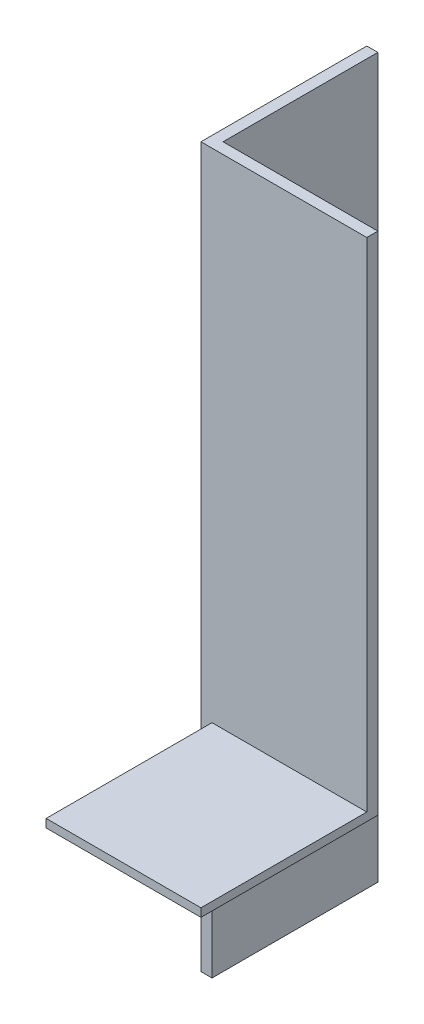
ISO-10303-21;
HEADER;
FILE_DESCRIPTION(('STEP AP214'),'2;1');
FILE_NAME('part.step','',(''),(''),'','','');
FILE_SCHEMA(('AUTOMOTIVE_DESIGN { 1 0 10303 214 1 1 1 1 }'));
ENDSEC;
DATA;
#1=APPLICATION_CONTEXT('core data for automotive mechanical design processes');
#2=APPLICATION_PROTOCOL_DEFINITION('international standard','automotive_design',2000,#1);
#3=PRODUCT_CONTEXT('',#1,'mechanical');
#4=PRODUCT('Part','Part','',(#3));
#5=PRODUCT_RELATED_PRODUCT_CATEGORY('part','',(#4));
#6=PRODUCT_DEFINITION_FORMATION('','',#4);
#7=PRODUCT_DEFINITION_CONTEXT('part definition',#1,'design');
#8=PRODUCT_DEFINITION('design','',#6,#7);
#9=PRODUCT_DEFINITION_SHAPE('','',#8);
#10=(LENGTH_UNIT() NAMED_UNIT(*) SI_UNIT(.MILLI.,.METRE.));
#11=(NAMED_UNIT(*) PLANE_ANGLE_UNIT() SI_UNIT($,.RADIAN.));
#12=(NAMED_UNIT(*) SI_UNIT($,.STERADIAN.) SOLID_ANGLE_UNIT());
#13=UNCERTAINTY_MEASURE_WITH_UNIT(LENGTH_MEASURE(1.E-05),#10,'distance_accuracy_value','');
#14=(GEOMETRIC_REPRESENTATION_CONTEXT(3) GLOBAL_UNCERTAINTY_ASSIGNED_CONTEXT((#13)) GLOBAL_UNIT_ASSIGNED_CONTEXT((#10,
#11,#12)) REPRESENTATION_CONTEXT('',''));
#15=CARTESIAN_POINT('',(0.,0.,0.));
#16=DIRECTION('',(0.,0.,1.));
#17=DIRECTION('',(1.,0.,0.));
#18=AXIS2_PLACEMENT_3D('',#15,#16,#17);
#19=CARTESIAN_POINT('',(15.,65.,0.));
#20=DIRECTION('',(0.,0.,-1.));
#21=DIRECTION('',(-1.,0.,0.));
#22=AXIS2_PLACEMENT_3D('',#19,#20,#21);
#23=PLANE('',#22);
#24=DIRECTION('',(0.,-1.,0.));
#25=VECTOR('',#24,1.);
#26=CARTESIAN_POINT('',(0.999999999999998,34.0356688476182,0.));
#27=LINE('',#26,#25);
#28=CARTESIAN_POINT('',(0.999999999999998,20.,0.));
#29=VERTEX_POINT('',#28);
#30=CARTESIAN_POINT('',(0.999999999999998,19.25,0.));
#31=VERTEX_POINT('',#30);
#32=EDGE_CURVE('E147',#29,#31,#27,.T.);
#33=ORIENTED_EDGE('',*,*,#32,.F.);
#34=DIRECTION('',(-1.,0.,0.));
#35=VECTOR('',#34,1.);
#36=CARTESIAN_POINT('',(15.,20.,0.));
#37=LINE('',#36,#35);
#38=CARTESIAN_POINT('',(15.,20.,0.));
#39=VERTEX_POINT('',#38);
#40=EDGE_CURVE('E113',#39,#29,#37,.T.);
#41=ORIENTED_EDGE('',*,*,#40,.F.);
#42=DIRECTION('',(0.,-1.,0.));
#43=VECTOR('',#42,1.);
#44=CARTESIAN_POINT('',(15.,65.,0.));
#45=LINE('',#44,#43);
#46=CARTESIAN_POINT('',(15.,65.,0.));
#47=VERTEX_POINT('',#46);
#48=EDGE_CURVE('E11',#47,#39,#45,.T.);
#49=ORIENTED_EDGE('',*,*,#48,.F.);
#50=DIRECTION('',(1.,0.,0.));
#51=VECTOR('',#50,1.);
#52=CARTESIAN_POINT('',(15.,65.,0.));
#53=LINE('',#52,#51);
#54=CARTESIAN_POINT('',(0.,65.,0.));
#55=VERTEX_POINT('',#54);
#56=EDGE_CURVE('E150',#55,#47,#53,.T.);
#57=ORIENTED_EDGE('',*,*,#56,.F.);
#58=DIRECTION('',(0.,-1.,0.));
#59=VECTOR('',#58,1.);
#60=CARTESIAN_POINT('',(0.,65.,0.));
#61=LINE('',#60,#59);
#62=CARTESIAN_POINT('',(0.,0.,0.));
#63=VERTEX_POINT('',#62);
#64=EDGE_CURVE('E164',#55,#63,#61,.T.);
#65=ORIENTED_EDGE('',*,*,#64,.T.);
#66=DIRECTION('',(1.,0.,0.));
#67=VECTOR('',#66,1.);
#68=CARTESIAN_POINT('',(15.,0.,0.));
#69=LINE('',#68,#67);
#70=CARTESIAN_POINT('',(0.999999999999999,0.,0.));
#71=VERTEX_POINT('',#70);
#72=EDGE_CURVE('E149',#63,#71,#69,.T.);
#73=ORIENTED_EDGE('',*,*,#72,.T.);
#74=EDGE_CURVE('E146',#31,#71,#27,.T.);
#75=ORIENTED_EDGE('',*,*,#74,.F.);
#76=EDGE_LOOP('',(#33,#41,#49,#57,#65,#73,#75));
#77=FACE_BOUND('',#76,.T.);
#78=ADVANCED_FACE('F35',(#77),#23,.F.);
#79=CARTESIAN_POINT('',(15.,65.,-0.999999999999998));
#80=DIRECTION('',(-1.,0.,0.));
#81=DIRECTION('',(0.,0.,1.));
#82=AXIS2_PLACEMENT_3D('',#79,#80,#81);
#83=PLANE('',#82);
#84=ORIENTED_EDGE('',*,*,#48,.T.);
#85=DIRECTION('',(0.,0.,-1.));
#86=VECTOR('',#85,1.);
#87=CARTESIAN_POINT('',(15.,20.,15.));
#88=LINE('',#87,#86);
#89=CARTESIAN_POINT('',(15.,20.,15.));
#90=VERTEX_POINT('',#89);
#91=EDGE_CURVE('E117',#90,#39,#88,.T.);
#92=ORIENTED_EDGE('',*,*,#91,.F.);
#93=DIRECTION('',(0.,-1.,0.));
#94=VECTOR('',#93,1.);
#95=CARTESIAN_POINT('',(15.,20.,15.));
#96=LINE('',#95,#94);
#97=CARTESIAN_POINT('',(15.,19.25,15.));
#98=VERTEX_POINT('',#97);
#99=EDGE_CURVE('E128',#90,#98,#96,.T.);
#100=ORIENTED_EDGE('',*,*,#99,.T.);
#101=DIRECTION('',(0.,0.,-1.));
#102=VECTOR('',#101,1.);
#103=CARTESIAN_POINT('',(15.,19.25,15.));
#104=LINE('',#103,#102);
#105=CARTESIAN_POINT('',(15.,19.25,-0.999999999999997));
#106=VERTEX_POINT('',#105);
#107=EDGE_CURVE('E141',#98,#106,#104,.T.);
#108=ORIENTED_EDGE('',*,*,#107,.T.);
#109=DIRECTION('',(0.,-1.,0.));
#110=VECTOR('',#109,1.);
#111=CARTESIAN_POINT('',(15.,65.,-0.999999999999998));
#112=LINE('',#111,#110);
#113=CARTESIAN_POINT('',(15.,65.,-0.999999999999998));
#114=VERTEX_POINT('',#113);
#115=EDGE_CURVE('E42',#114,#106,#112,.T.);
#116=ORIENTED_EDGE('',*,*,#115,.F.);
#117=DIRECTION('',(0.,0.,-1.));
#118=VECTOR('',#117,1.);
#119=CARTESIAN_POINT('',(15.,65.,-0.999999999999998));
#120=LINE('',#119,#118);
#121=EDGE_CURVE('E153',#47,#114,#120,.T.);
#122=ORIENTED_EDGE('',*,*,#121,.F.);
#123=EDGE_LOOP('',(#84,#92,#100,#108,#116,#122));
#124=FACE_BOUND('',#123,.T.);
#125=ADVANCED_FACE('F186',(#124),#83,.F.);
#126=CARTESIAN_POINT('',(1.,65.,-0.999999999999997));
#127=DIRECTION('',(0.,0.,1.));
#128=DIRECTION('',(1.,0.,0.));
#129=AXIS2_PLACEMENT_3D('',#126,#127,#128);
#130=PLANE('',#129);
#131=ORIENTED_EDGE('',*,*,#115,.T.);
#132=DIRECTION('',(-1.,0.,0.));
#133=VECTOR('',#132,1.);
#134=CARTESIAN_POINT('',(1.,19.25,-0.999999999999997));
#135=LINE('',#134,#133);
#136=CARTESIAN_POINT('',(1.,19.25,-0.999999999999997));
#137=VERTEX_POINT('',#136);
#138=EDGE_CURVE('E133',#106,#137,#135,.T.);
#139=ORIENTED_EDGE('',*,*,#138,.T.);
#140=DIRECTION('',(0.,-1.,0.));
#141=VECTOR('',#140,1.);
#142=CARTESIAN_POINT('',(1.,65.,-0.999999999999997));
#143=LINE('',#142,#141);
#144=CARTESIAN_POINT('',(1.,65.,-0.999999999999997));
#145=VERTEX_POINT('',#144);
#146=EDGE_CURVE('E49',#145,#137,#143,.T.);
#147=ORIENTED_EDGE('',*,*,#146,.F.);
#148=DIRECTION('',(-1.,0.,0.));
#149=VECTOR('',#148,1.);
#150=CARTESIAN_POINT('',(1.,65.,-0.999999999999997));
#151=LINE('',#150,#149);
#152=EDGE_CURVE('E156',#114,#145,#151,.T.);
#153=ORIENTED_EDGE('',*,*,#152,.F.);
#154=EDGE_LOOP('',(#131,#139,#147,#153));
#155=FACE_BOUND('',#154,.T.);
#156=ADVANCED_FACE('F183',(#155),#130,.F.);
#157=CARTESIAN_POINT('',(0.999999999999998,65.,-15.));
#158=DIRECTION('',(-1.,0.,0.));
#159=DIRECTION('',(0.,0.,1.));
#160=AXIS2_PLACEMENT_3D('',#157,#158,#159);
#161=PLANE('',#160);
#162=ORIENTED_EDGE('',*,*,#146,.T.);
#163=DIRECTION('',(0.,0.,-1.));
#164=VECTOR('',#163,1.);
#165=CARTESIAN_POINT('',(1.,19.25,15.));
#166=LINE('',#165,#164);
#167=EDGE_CURVE('E53',#31,#137,#166,.T.);
#168=ORIENTED_EDGE('',*,*,#167,.F.);
#169=ORIENTED_EDGE('',*,*,#74,.T.);
#170=DIRECTION('',(0.,0.,-1.));
#171=VECTOR('',#170,1.);
#172=CARTESIAN_POINT('',(0.999999999999998,0.,-15.));
#173=LINE('',#172,#171);
#174=CARTESIAN_POINT('',(0.999999999999998,0.,-15.));
#175=VERTEX_POINT('',#174);
#176=EDGE_CURVE('E167',#71,#175,#173,.T.);
#177=ORIENTED_EDGE('',*,*,#176,.T.);
#178=DIRECTION('',(0.,-1.,0.));
#179=VECTOR('',#178,1.);
#180=CARTESIAN_POINT('',(0.999999999999998,65.,-15.));
#181=LINE('',#180,#179);
#182=CARTESIAN_POINT('',(0.999999999999998,65.,-15.));
#183=VERTEX_POINT('',#182);
#184=EDGE_CURVE('E177',#183,#175,#181,.T.);
#185=ORIENTED_EDGE('',*,*,#184,.F.);
#186=DIRECTION('',(0.,0.,-1.));
#187=VECTOR('',#186,1.);
#188=CARTESIAN_POINT('',(0.999999999999998,65.,-15.));
#189=LINE('',#188,#187);
#190=EDGE_CURVE('E158',#145,#183,#189,.T.);
#191=ORIENTED_EDGE('',*,*,#190,.F.);
#192=EDGE_LOOP('',(#162,#168,#169,#177,#185,#191));
#193=FACE_BOUND('',#192,.T.);
#194=ADVANCED_FACE('F206',(#193),#161,.F.);
#195=CARTESIAN_POINT('',(0.,65.,-15.));
#196=DIRECTION('',(0.,0.,1.));
#197=DIRECTION('',(1.,0.,0.));
#198=AXIS2_PLACEMENT_3D('',#195,#196,#197);
#199=PLANE('',#198);
#200=DIRECTION('',(-1.,0.,0.));
#201=VECTOR('',#200,1.);
#202=CARTESIAN_POINT('',(0.,0.,-15.));
#203=LINE('',#202,#201);
#204=CARTESIAN_POINT('',(0.,0.,-15.));
#205=VERTEX_POINT('',#204);
#206=EDGE_CURVE('E169',#175,#205,#203,.T.);
#207=ORIENTED_EDGE('',*,*,#206,.T.);
#208=DIRECTION('',(0.,-1.,0.));
#209=VECTOR('',#208,1.);
#210=CARTESIAN_POINT('',(0.,65.,-15.));
#211=LINE('',#210,#209);
#212=CARTESIAN_POINT('',(0.,65.,-15.));
#213=VERTEX_POINT('',#212);
#214=EDGE_CURVE('E174',#213,#205,#211,.T.);
#215=ORIENTED_EDGE('',*,*,#214,.F.);
#216=DIRECTION('',(-1.,0.,0.));
#217=VECTOR('',#216,1.);
#218=CARTESIAN_POINT('',(0.,65.,-15.));
#219=LINE('',#218,#217);
#220=EDGE_CURVE('E160',#183,#213,#219,.T.);
#221=ORIENTED_EDGE('',*,*,#220,.F.);
#222=ORIENTED_EDGE('',*,*,#184,.T.);
#223=EDGE_LOOP('',(#207,#215,#221,#222));
#224=FACE_BOUND('',#223,.T.);
#225=ADVANCED_FACE('F214',(#224),#199,.F.);
#226=CARTESIAN_POINT('',(0.,65.,0.));
#227=DIRECTION('',(1.,0.,0.));
#228=DIRECTION('',(0.,0.,-1.));
#229=AXIS2_PLACEMENT_3D('',#226,#227,#228);
#230=PLANE('',#229);
#231=DIRECTION('',(0.,0.,1.));
#232=VECTOR('',#231,1.);
#233=CARTESIAN_POINT('',(0.,0.,0.));
#234=LINE('',#233,#232);
#235=EDGE_CURVE('E154',#205,#63,#234,.T.);
#236=ORIENTED_EDGE('',*,*,#235,.T.);
#237=ORIENTED_EDGE('',*,*,#64,.F.);
#238=DIRECTION('',(0.,0.,1.));
#239=VECTOR('',#238,1.);
#240=CARTESIAN_POINT('',(0.,65.,0.));
#241=LINE('',#240,#239);
#242=EDGE_CURVE('E162',#213,#55,#241,.T.);
#243=ORIENTED_EDGE('',*,*,#242,.F.);
#244=ORIENTED_EDGE('',*,*,#214,.T.);
#245=EDGE_LOOP('',(#236,#237,#243,#244));
#246=FACE_BOUND('',#245,.T.);
#247=ADVANCED_FACE('F218',(#246),#230,.F.);
#248=CARTESIAN_POINT('',(0.,65.,0.));
#249=DIRECTION('',(0.,-1.,0.));
#250=DIRECTION('',(0.,0.,-1.));
#251=AXIS2_PLACEMENT_3D('',#248,#249,#250);
#252=PLANE('',#251);
#253=ORIENTED_EDGE('',*,*,#56,.T.);
#254=ORIENTED_EDGE('',*,*,#121,.T.);
#255=ORIENTED_EDGE('',*,*,#152,.T.);
#256=ORIENTED_EDGE('',*,*,#190,.T.);
#257=ORIENTED_EDGE('',*,*,#220,.T.);
#258=ORIENTED_EDGE('',*,*,#242,.T.);
#259=EDGE_LOOP('',(#253,#254,#255,#256,#257,#258));
#260=FACE_BOUND('',#259,.T.);
#261=ADVANCED_FACE('F222',(#260),#252,.F.);
#262=CARTESIAN_POINT('',(0.,0.,0.));
#263=DIRECTION('',(0.,-1.,0.));
#264=DIRECTION('',(0.,0.,-1.));
#265=AXIS2_PLACEMENT_3D('',#262,#263,#264);
#266=PLANE('',#265);
#267=ORIENTED_EDGE('',*,*,#176,.F.);
#268=ORIENTED_EDGE('',*,*,#72,.F.);
#269=ORIENTED_EDGE('',*,*,#235,.F.);
#270=ORIENTED_EDGE('',*,*,#206,.F.);
#271=EDGE_LOOP('',(#267,#268,#269,#270));
#272=FACE_BOUND('',#271,.T.);
#273=ADVANCED_FACE('F210',(#272),#266,.T.);
#274=CARTESIAN_POINT('',(1.,20.,15.));
#275=DIRECTION('',(0.,1.,0.));
#276=DIRECTION('',(-1.,0.,0.));
#277=AXIS2_PLACEMENT_3D('',#274,#275,#276);
#278=PLANE('',#277);
#279=ORIENTED_EDGE('',*,*,#40,.T.);
#280=DIRECTION('',(0.,0.,-1.));
#281=VECTOR('',#280,1.);
#282=CARTESIAN_POINT('',(1.,20.,15.));
#283=LINE('',#282,#281);
#284=CARTESIAN_POINT('',(1.,20.,15.));
#285=VERTEX_POINT('',#284);
#286=EDGE_CURVE('E108',#285,#29,#283,.T.);
#287=ORIENTED_EDGE('',*,*,#286,.F.);
#288=DIRECTION('',(1.,0.,0.));
#289=VECTOR('',#288,1.);
#290=CARTESIAN_POINT('',(1.,20.,15.));
#291=LINE('',#290,#289);
#292=EDGE_CURVE('E112',#285,#90,#291,.T.);
#293=ORIENTED_EDGE('',*,*,#292,.T.);
#294=ORIENTED_EDGE('',*,*,#91,.T.);
#295=EDGE_LOOP('',(#279,#287,#293,#294));
#296=FACE_BOUND('',#295,.T.);
#297=ADVANCED_FACE('F110',(#296),#278,.T.);
#298=CARTESIAN_POINT('',(1.,20.,15.));
#299=DIRECTION('',(-1.,0.,0.));
#300=DIRECTION('',(0.,-1.,0.));
#301=AXIS2_PLACEMENT_3D('',#298,#299,#300);
#302=PLANE('',#301);
#303=ORIENTED_EDGE('',*,*,#32,.T.);
#304=CARTESIAN_POINT('',(1.,19.25,15.));
#305=VERTEX_POINT('',#304);
#306=EDGE_CURVE('E132',#305,#31,#166,.T.);
#307=ORIENTED_EDGE('',*,*,#306,.F.);
#308=DIRECTION('',(0.,1.,0.));
#309=VECTOR('',#308,1.);
#310=CARTESIAN_POINT('',(1.,20.,15.));
#311=LINE('',#310,#309);
#312=EDGE_CURVE('E125',#305,#285,#311,.T.);
#313=ORIENTED_EDGE('',*,*,#312,.T.);
#314=ORIENTED_EDGE('',*,*,#286,.T.);
#315=EDGE_LOOP('',(#303,#307,#313,#314));
#316=FACE_BOUND('',#315,.T.);
#317=ADVANCED_FACE('F130',(#316),#302,.T.);
#318=CARTESIAN_POINT('',(1.,19.25,15.));
#319=DIRECTION('',(0.,-1.,0.));
#320=DIRECTION('',(0.,0.,-1.));
#321=AXIS2_PLACEMENT_3D('',#318,#319,#320);
#322=PLANE('',#321);
#323=ORIENTED_EDGE('',*,*,#138,.F.);
#324=ORIENTED_EDGE('',*,*,#107,.F.);
#325=DIRECTION('',(-1.,0.,0.));
#326=VECTOR('',#325,1.);
#327=CARTESIAN_POINT('',(1.,19.25,15.));
#328=LINE('',#327,#326);
#329=EDGE_CURVE('E118',#98,#305,#328,.T.);
#330=ORIENTED_EDGE('',*,*,#329,.T.);
#331=ORIENTED_EDGE('',*,*,#306,.T.);
#332=ORIENTED_EDGE('',*,*,#167,.T.);
#333=EDGE_LOOP('',(#323,#324,#330,#331,#332));
#334=FACE_BOUND('',#333,.T.);
#335=ADVANCED_FACE('F188',(#334),#322,.T.);
#336=CARTESIAN_POINT('',(0.,0.,15.));
#337=DIRECTION('',(0.,0.,1.));
#338=DIRECTION('',(1.,0.,0.));
#339=AXIS2_PLACEMENT_3D('',#336,#337,#338);
#340=PLANE('',#339);
#341=ORIENTED_EDGE('',*,*,#312,.F.);
#342=ORIENTED_EDGE('',*,*,#329,.F.);
#343=ORIENTED_EDGE('',*,*,#99,.F.);
#344=ORIENTED_EDGE('',*,*,#292,.F.);
#345=EDGE_LOOP('',(#341,#342,#343,#344));
#346=FACE_BOUND('',#345,.T.);
#347=ADVANCED_FACE('F123',(#346),#340,.T.);
#348=CLOSED_SHELL('',(#78,#125,#156,#194,#225,#247,#261,#273,#297,#317,#335,#347));
#349=MANIFOLD_SOLID_BREP('B2',#348);
#350=ADVANCED_BREP_SHAPE_REPRESENTATION('',(#18,#349),#14);
#351=SHAPE_DEFINITION_REPRESENTATION(#9,#350);
ENDSEC;
END-ISO-10303-21;
